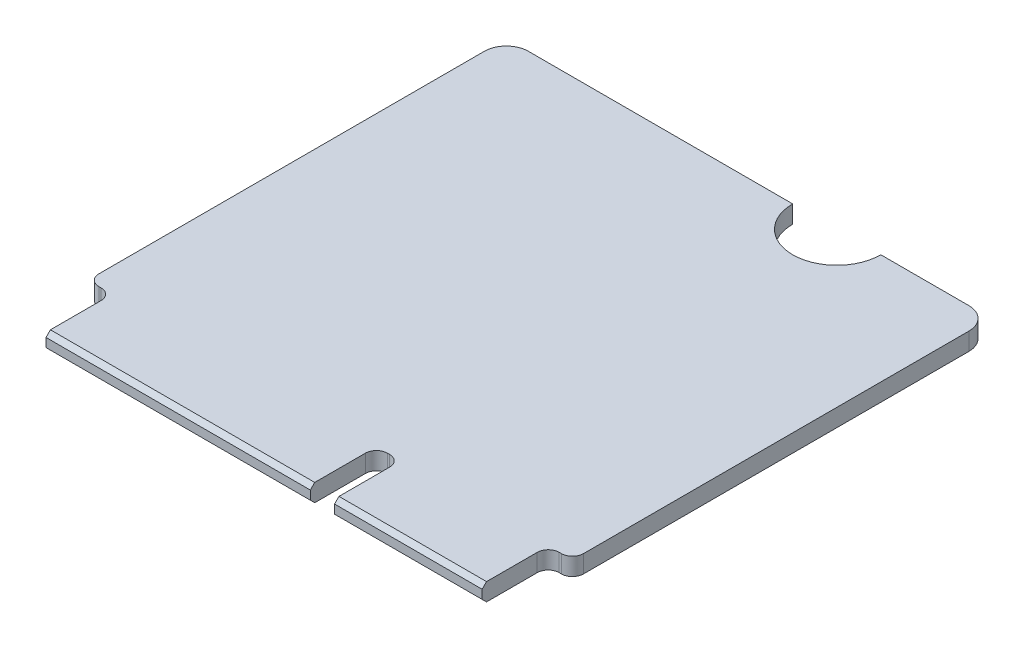
ISO-10303-21;
HEADER;
FILE_DESCRIPTION(('STEP AP214'),'2;1');
FILE_NAME('part.step','',(''),(''),'','','');
FILE_SCHEMA(('AUTOMOTIVE_DESIGN { 1 0 10303 214 1 1 1 1 }'));
ENDSEC;
DATA;
#1=APPLICATION_CONTEXT('core data for automotive mechanical design processes');
#2=APPLICATION_PROTOCOL_DEFINITION('international standard','automotive_design',2000,#1);
#3=PRODUCT_CONTEXT('',#1,'mechanical');
#4=PRODUCT('Part','Part','',(#3));
#5=PRODUCT_RELATED_PRODUCT_CATEGORY('part','',(#4));
#6=PRODUCT_DEFINITION_FORMATION('','',#4);
#7=PRODUCT_DEFINITION_CONTEXT('part definition',#1,'design');
#8=PRODUCT_DEFINITION('design','',#6,#7);
#9=PRODUCT_DEFINITION_SHAPE('','',#8);
#10=(LENGTH_UNIT() NAMED_UNIT(*) SI_UNIT(.MILLI.,.METRE.));
#11=(NAMED_UNIT(*) PLANE_ANGLE_UNIT() SI_UNIT($,.RADIAN.));
#12=(NAMED_UNIT(*) SI_UNIT($,.STERADIAN.) SOLID_ANGLE_UNIT());
#13=UNCERTAINTY_MEASURE_WITH_UNIT(LENGTH_MEASURE(1.E-05),#10,'distance_accuracy_value','');
#14=(GEOMETRIC_REPRESENTATION_CONTEXT(3) GLOBAL_UNCERTAINTY_ASSIGNED_CONTEXT((#13)) GLOBAL_UNIT_ASSIGNED_CONTEXT((#10,
#11,#12)) REPRESENTATION_CONTEXT('',''));
#15=CARTESIAN_POINT('',(0.,0.,0.));
#16=DIRECTION('',(0.,0.,1.));
#17=DIRECTION('',(1.,0.,0.));
#18=AXIS2_PLACEMENT_3D('',#15,#16,#17);
#19=CARTESIAN_POINT('',(0.,0.8,0.));
#20=DIRECTION('',(1.,0.,0.));
#21=DIRECTION('',(0.,0.,-1.));
#22=AXIS2_PLACEMENT_3D('',#19,#20,#21);
#23=PLANE('',#22);
#24=DIRECTION('',(0.,0.,1.));
#25=VECTOR('',#24,1.);
#26=CARTESIAN_POINT('',(0.,0.,0.));
#27=LINE('',#26,#25);
#28=CARTESIAN_POINT('',(0.,0.,1.));
#29=VERTEX_POINT('',#28);
#30=CARTESIAN_POINT('',(0.,0.,18.5));
#31=VERTEX_POINT('',#30);
#32=EDGE_CURVE('E238',#29,#31,#27,.T.);
#33=ORIENTED_EDGE('',*,*,#32,.T.);
#34=DIRECTION('',(0.,-1.,0.));
#35=VECTOR('',#34,1.);
#36=CARTESIAN_POINT('',(0.,0.8,18.5));
#37=LINE('',#36,#35);
#38=CARTESIAN_POINT('',(0.,0.8,18.5));
#39=VERTEX_POINT('',#38);
#40=EDGE_CURVE('E306',#31,#39,#37,.F.);
#41=ORIENTED_EDGE('',*,*,#40,.T.);
#42=DIRECTION('',(0.,0.,1.));
#43=VECTOR('',#42,1.);
#44=CARTESIAN_POINT('',(0.,0.8,0.));
#45=LINE('',#44,#43);
#46=CARTESIAN_POINT('',(0.,0.8,1.));
#47=VERTEX_POINT('',#46);
#48=EDGE_CURVE('E267',#47,#39,#45,.T.);
#49=ORIENTED_EDGE('',*,*,#48,.F.);
#50=DIRECTION('',(0.,-1.,0.));
#51=VECTOR('',#50,1.);
#52=CARTESIAN_POINT('',(0.,0.8,1.));
#53=LINE('',#52,#51);
#54=EDGE_CURVE('E292',#47,#29,#53,.T.);
#55=ORIENTED_EDGE('',*,*,#54,.T.);
#56=EDGE_LOOP('',(#33,#41,#49,#55));
#57=FACE_BOUND('',#56,.T.);
#58=ADVANCED_FACE('F33',(#57),#23,.F.);
#59=CARTESIAN_POINT('',(0.,0.8,19.));
#60=DIRECTION('',(0.,0.,-1.));
#61=DIRECTION('',(-1.,0.,0.));
#62=AXIS2_PLACEMENT_3D('',#59,#60,#61);
#63=PLANE('',#62);
#64=DIRECTION('',(1.,0.,0.));
#65=VECTOR('',#64,1.);
#66=CARTESIAN_POINT('',(0.,0.8,19.));
#67=LINE('',#66,#65);
#68=CARTESIAN_POINT('',(0.500000000000002,0.8,19.));
#69=VERTEX_POINT('',#68);
#70=CARTESIAN_POINT('',(0.600000000000002,0.8,19.));
#71=VERTEX_POINT('',#70);
#72=EDGE_CURVE('E397',#69,#71,#67,.T.);
#73=ORIENTED_EDGE('',*,*,#72,.F.);
#74=DIRECTION('',(0.,-1.,0.));
#75=VECTOR('',#74,1.);
#76=CARTESIAN_POINT('',(0.500000000000002,0.8,19.));
#77=LINE('',#76,#75);
#78=CARTESIAN_POINT('',(0.500000000000002,0.,19.));
#79=VERTEX_POINT('',#78);
#80=EDGE_CURVE('E299',#69,#79,#77,.T.);
#81=ORIENTED_EDGE('',*,*,#80,.T.);
#82=DIRECTION('',(1.,0.,0.));
#83=VECTOR('',#82,1.);
#84=CARTESIAN_POINT('',(0.,0.,19.));
#85=LINE('',#84,#83);
#86=CARTESIAN_POINT('',(0.600000000000002,0.,19.));
#87=VERTEX_POINT('',#86);
#88=EDGE_CURVE('E241',#79,#87,#85,.T.);
#89=ORIENTED_EDGE('',*,*,#88,.T.);
#90=DIRECTION('',(0.,-1.,0.));
#91=VECTOR('',#90,1.);
#92=CARTESIAN_POINT('',(0.600000000000002,0.8,19.));
#93=LINE('',#92,#91);
#94=EDGE_CURVE('E297',#87,#71,#93,.F.);
#95=ORIENTED_EDGE('',*,*,#94,.T.);
#96=EDGE_LOOP('',(#73,#81,#89,#95));
#97=FACE_BOUND('',#96,.T.);
#98=ADVANCED_FACE('F462',(#97),#63,.F.);
#99=CARTESIAN_POINT('',(1.1,0.8,19.));
#100=DIRECTION('',(1.,0.,0.));
#101=DIRECTION('',(0.,0.,-1.));
#102=AXIS2_PLACEMENT_3D('',#99,#100,#101);
#103=PLANE('',#102);
#104=DIRECTION('',(0.,0.,1.));
#105=VECTOR('',#104,1.);
#106=CARTESIAN_POINT('',(1.1,0.,19.));
#107=LINE('',#106,#105);
#108=CARTESIAN_POINT('',(1.1,0.,19.5));
#109=VERTEX_POINT('',#108);
#110=CARTESIAN_POINT('',(1.1,0.,21.8));
#111=VERTEX_POINT('',#110);
#112=EDGE_CURVE('E244',#109,#111,#107,.T.);
#113=ORIENTED_EDGE('',*,*,#112,.T.);
#114=DIRECTION('',(0.,-0.707106781186548,-0.707106781186548));
#115=VECTOR('',#114,1.);
#116=CARTESIAN_POINT('',(1.1,0.199999999999999,22.));
#117=LINE('',#116,#115);
#118=CARTESIAN_POINT('',(1.1,0.199999999999999,22.));
#119=VERTEX_POINT('',#118);
#120=EDGE_CURVE('E11',#111,#119,#117,.F.);
#121=ORIENTED_EDGE('',*,*,#120,.T.);
#122=DIRECTION('',(0.,-1.,0.));
#123=VECTOR('',#122,1.);
#124=CARTESIAN_POINT('',(1.1,0.8,22.));
#125=LINE('',#124,#123);
#126=CARTESIAN_POINT('',(1.1,0.600000000000001,22.));
#127=VERTEX_POINT('',#126);
#128=EDGE_CURVE('E277',#127,#119,#125,.T.);
#129=ORIENTED_EDGE('',*,*,#128,.F.);
#130=DIRECTION('',(0.,0.707106781186548,-0.707106781186548));
#131=VECTOR('',#130,1.);
#132=CARTESIAN_POINT('',(1.1,0.800000000000005,21.8));
#133=LINE('',#132,#131);
#134=CARTESIAN_POINT('',(1.1,0.8,21.8));
#135=VERTEX_POINT('',#134);
#136=EDGE_CURVE('E41',#127,#135,#133,.T.);
#137=ORIENTED_EDGE('',*,*,#136,.T.);
#138=DIRECTION('',(0.,0.,1.));
#139=VECTOR('',#138,1.);
#140=CARTESIAN_POINT('',(1.1,0.8,19.));
#141=LINE('',#140,#139);
#142=CARTESIAN_POINT('',(1.1,0.8,19.5));
#143=VERTEX_POINT('',#142);
#144=EDGE_CURVE('E389',#143,#135,#141,.T.);
#145=ORIENTED_EDGE('',*,*,#144,.F.);
#146=DIRECTION('',(0.,-1.,0.));
#147=VECTOR('',#146,1.);
#148=CARTESIAN_POINT('',(1.1,0.,19.5));
#149=LINE('',#148,#147);
#150=EDGE_CURVE('E312',#143,#109,#149,.T.);
#151=ORIENTED_EDGE('',*,*,#150,.T.);
#152=EDGE_LOOP('',(#113,#121,#129,#137,#145,#151));
#153=FACE_BOUND('',#152,.T.);
#154=ADVANCED_FACE('F388',(#153),#103,.F.);
#155=CARTESIAN_POINT('',(1.1,0.8,22.));
#156=DIRECTION('',(0.,0.,-1.));
#157=DIRECTION('',(-1.,0.,0.));
#158=AXIS2_PLACEMENT_3D('',#155,#156,#157);
#159=PLANE('',#158);
#160=ORIENTED_EDGE('',*,*,#128,.T.);
#161=DIRECTION('',(1.,0.,0.));
#162=VECTOR('',#161,1.);
#163=CARTESIAN_POINT('',(1.1,0.199999999999999,22.));
#164=LINE('',#163,#162);
#165=CARTESIAN_POINT('',(13.1,0.199999999999999,22.));
#166=VERTEX_POINT('',#165);
#167=EDGE_CURVE('E379',#119,#166,#164,.T.);
#168=ORIENTED_EDGE('',*,*,#167,.T.);
#169=DIRECTION('',(0.,-1.,0.));
#170=VECTOR('',#169,1.);
#171=CARTESIAN_POINT('',(13.1,0.8,22.));
#172=LINE('',#171,#170);
#173=CARTESIAN_POINT('',(13.1,0.600000000000001,22.));
#174=VERTEX_POINT('',#173);
#175=EDGE_CURVE('E274',#174,#166,#172,.T.);
#176=ORIENTED_EDGE('',*,*,#175,.F.);
#177=DIRECTION('',(-1.,0.,0.));
#178=VECTOR('',#177,1.);
#179=CARTESIAN_POINT('',(1.1,0.600000000000001,22.));
#180=LINE('',#179,#178);
#181=EDGE_CURVE('E53',#174,#127,#180,.T.);
#182=ORIENTED_EDGE('',*,*,#181,.T.);
#183=EDGE_LOOP('',(#160,#168,#176,#182));
#184=FACE_BOUND('',#183,.T.);
#185=ADVANCED_FACE('F401',(#184),#159,.F.);
#186=CARTESIAN_POINT('',(13.1,0.8,22.));
#187=DIRECTION('',(-1.,0.,0.));
#188=DIRECTION('',(0.,0.,1.));
#189=AXIS2_PLACEMENT_3D('',#186,#187,#188);
#190=PLANE('',#189);
#191=ORIENTED_EDGE('',*,*,#175,.T.);
#192=DIRECTION('',(0.,0.707106781186548,0.707106781186548));
#193=VECTOR('',#192,1.);
#194=CARTESIAN_POINT('',(13.1,0.199999999999999,22.));
#195=LINE('',#194,#193);
#196=CARTESIAN_POINT('',(13.1,0.,21.8));
#197=VERTEX_POINT('',#196);
#198=EDGE_CURVE('E384',#166,#197,#195,.F.);
#199=ORIENTED_EDGE('',*,*,#198,.T.);
#200=DIRECTION('',(0.,0.,-1.));
#201=VECTOR('',#200,1.);
#202=CARTESIAN_POINT('',(13.1,0.,22.));
#203=LINE('',#202,#201);
#204=CARTESIAN_POINT('',(13.1,0.,19.5));
#205=VERTEX_POINT('',#204);
#206=EDGE_CURVE('E246',#197,#205,#203,.T.);
#207=ORIENTED_EDGE('',*,*,#206,.T.);
#208=DIRECTION('',(0.,-1.,0.));
#209=VECTOR('',#208,1.);
#210=CARTESIAN_POINT('',(13.1,0.8,19.5));
#211=LINE('',#210,#209);
#212=CARTESIAN_POINT('',(13.1,0.8,19.5));
#213=VERTEX_POINT('',#212);
#214=EDGE_CURVE('E323',#205,#213,#211,.F.);
#215=ORIENTED_EDGE('',*,*,#214,.T.);
#216=DIRECTION('',(0.,0.,-1.));
#217=VECTOR('',#216,1.);
#218=CARTESIAN_POINT('',(13.1,0.8,22.));
#219=LINE('',#218,#217);
#220=CARTESIAN_POINT('',(13.1,0.8,21.8));
#221=VERTEX_POINT('',#220);
#222=EDGE_CURVE('E396',#221,#213,#219,.T.);
#223=ORIENTED_EDGE('',*,*,#222,.F.);
#224=DIRECTION('',(0.,-0.707106781186548,0.707106781186548));
#225=VECTOR('',#224,1.);
#226=CARTESIAN_POINT('',(13.1,0.8,21.8));
#227=LINE('',#226,#225);
#228=EDGE_CURVE('E382',#221,#174,#227,.T.);
#229=ORIENTED_EDGE('',*,*,#228,.T.);
#230=EDGE_LOOP('',(#191,#199,#207,#215,#223,#229));
#231=FACE_BOUND('',#230,.T.);
#232=ADVANCED_FACE('F400',(#231),#190,.F.);
#233=CARTESIAN_POINT('',(13.1,0.8,19.));
#234=DIRECTION('',(0.,0.,-1.));
#235=DIRECTION('',(-1.,0.,0.));
#236=AXIS2_PLACEMENT_3D('',#233,#234,#235);
#237=PLANE('',#236);
#238=DIRECTION('',(1.,0.,0.));
#239=VECTOR('',#238,1.);
#240=CARTESIAN_POINT('',(13.1,0.,19.));
#241=LINE('',#240,#239);
#242=CARTESIAN_POINT('',(13.6,0.,19.));
#243=VERTEX_POINT('',#242);
#244=CARTESIAN_POINT('',(13.7,0.,19.));
#245=VERTEX_POINT('',#244);
#246=EDGE_CURVE('E248',#243,#245,#241,.T.);
#247=ORIENTED_EDGE('',*,*,#246,.T.);
#248=DIRECTION('',(0.,-1.,0.));
#249=VECTOR('',#248,1.);
#250=CARTESIAN_POINT('',(13.7,0.8,19.));
#251=LINE('',#250,#249);
#252=CARTESIAN_POINT('',(13.7,0.8,19.));
#253=VERTEX_POINT('',#252);
#254=EDGE_CURVE('E321',#245,#253,#251,.F.);
#255=ORIENTED_EDGE('',*,*,#254,.T.);
#256=DIRECTION('',(1.,0.,0.));
#257=VECTOR('',#256,1.);
#258=CARTESIAN_POINT('',(13.1,0.8,19.));
#259=LINE('',#258,#257);
#260=CARTESIAN_POINT('',(13.6,0.8,19.));
#261=VERTEX_POINT('',#260);
#262=EDGE_CURVE('E419',#261,#253,#259,.T.);
#263=ORIENTED_EDGE('',*,*,#262,.F.);
#264=DIRECTION('',(0.,-1.,0.));
#265=VECTOR('',#264,1.);
#266=CARTESIAN_POINT('',(13.6,0.,19.));
#267=LINE('',#266,#265);
#268=EDGE_CURVE('E318',#261,#243,#267,.T.);
#269=ORIENTED_EDGE('',*,*,#268,.T.);
#270=EDGE_LOOP('',(#247,#255,#263,#269));
#271=FACE_BOUND('',#270,.T.);
#272=ADVANCED_FACE('F422',(#271),#237,.F.);
#273=CARTESIAN_POINT('',(14.2,0.8,22.));
#274=DIRECTION('',(1.,0.,0.));
#275=DIRECTION('',(0.,0.,-1.));
#276=AXIS2_PLACEMENT_3D('',#273,#274,#275);
#277=PLANE('',#276);
#278=DIRECTION('',(0.,0.,1.));
#279=VECTOR('',#278,1.);
#280=CARTESIAN_POINT('',(14.2,0.,22.));
#281=LINE('',#280,#279);
#282=CARTESIAN_POINT('',(14.2,0.,19.5));
#283=VERTEX_POINT('',#282);
#284=CARTESIAN_POINT('',(14.2,0.,21.8));
#285=VERTEX_POINT('',#284);
#286=EDGE_CURVE('E251',#283,#285,#281,.T.);
#287=ORIENTED_EDGE('',*,*,#286,.T.);
#288=DIRECTION('',(0.,-0.707106781186548,-0.707106781186548));
#289=VECTOR('',#288,1.);
#290=CARTESIAN_POINT('',(14.2,0.199999999999999,22.));
#291=LINE('',#290,#289);
#292=CARTESIAN_POINT('',(14.2,0.199999999999999,22.));
#293=VERTEX_POINT('',#292);
#294=EDGE_CURVE('E370',#285,#293,#291,.F.);
#295=ORIENTED_EDGE('',*,*,#294,.T.);
#296=DIRECTION('',(0.,-1.,0.));
#297=VECTOR('',#296,1.);
#298=CARTESIAN_POINT('',(14.2,0.8,22.));
#299=LINE('',#298,#297);
#300=CARTESIAN_POINT('',(14.2,0.600000000000001,22.));
#301=VERTEX_POINT('',#300);
#302=EDGE_CURVE('E271',#301,#293,#299,.T.);
#303=ORIENTED_EDGE('',*,*,#302,.F.);
#304=DIRECTION('',(0.,0.707106781186548,-0.707106781186548));
#305=VECTOR('',#304,1.);
#306=CARTESIAN_POINT('',(14.2,0.8,21.8));
#307=LINE('',#306,#305);
#308=CARTESIAN_POINT('',(14.2,0.8,21.8));
#309=VERTEX_POINT('',#308);
#310=EDGE_CURVE('E368',#301,#309,#307,.T.);
#311=ORIENTED_EDGE('',*,*,#310,.T.);
#312=DIRECTION('',(0.,0.,1.));
#313=VECTOR('',#312,1.);
#314=CARTESIAN_POINT('',(14.2,0.8,22.));
#315=LINE('',#314,#313);
#316=CARTESIAN_POINT('',(14.2,0.8,19.5));
#317=VERTEX_POINT('',#316);
#318=EDGE_CURVE('E424',#317,#309,#315,.T.);
#319=ORIENTED_EDGE('',*,*,#318,.F.);
#320=DIRECTION('',(0.,-1.,0.));
#321=VECTOR('',#320,1.);
#322=CARTESIAN_POINT('',(14.2,0.,19.5));
#323=LINE('',#322,#321);
#324=EDGE_CURVE('E315',#317,#283,#323,.T.);
#325=ORIENTED_EDGE('',*,*,#324,.T.);
#326=EDGE_LOOP('',(#287,#295,#303,#311,#319,#325));
#327=FACE_BOUND('',#326,.T.);
#328=ADVANCED_FACE('F575',(#327),#277,.F.);
#329=CARTESIAN_POINT('',(14.2,0.8,22.));
#330=DIRECTION('',(0.,0.,-1.));
#331=DIRECTION('',(-1.,0.,0.));
#332=AXIS2_PLACEMENT_3D('',#329,#330,#331);
#333=PLANE('',#332);
#334=ORIENTED_EDGE('',*,*,#302,.T.);
#335=DIRECTION('',(1.,0.,0.));
#336=VECTOR('',#335,1.);
#337=CARTESIAN_POINT('',(14.2,0.199999999999999,22.));
#338=LINE('',#337,#336);
#339=CARTESIAN_POINT('',(20.9,0.199999999999999,22.));
#340=VERTEX_POINT('',#339);
#341=EDGE_CURVE('E357',#293,#340,#338,.T.);
#342=ORIENTED_EDGE('',*,*,#341,.T.);
#343=DIRECTION('',(0.,-1.,0.));
#344=VECTOR('',#343,1.);
#345=CARTESIAN_POINT('',(20.9,0.8,22.));
#346=LINE('',#345,#344);
#347=CARTESIAN_POINT('',(20.9,0.600000000000001,22.));
#348=VERTEX_POINT('',#347);
#349=EDGE_CURVE('E227',#348,#340,#346,.T.);
#350=ORIENTED_EDGE('',*,*,#349,.F.);
#351=DIRECTION('',(-1.,0.,0.));
#352=VECTOR('',#351,1.);
#353=CARTESIAN_POINT('',(14.2,0.600000000000001,22.));
#354=LINE('',#353,#352);
#355=EDGE_CURVE('E355',#348,#301,#354,.T.);
#356=ORIENTED_EDGE('',*,*,#355,.T.);
#357=EDGE_LOOP('',(#334,#342,#350,#356));
#358=FACE_BOUND('',#357,.T.);
#359=ADVANCED_FACE('F580',(#358),#333,.F.);
#360=CARTESIAN_POINT('',(20.9,0.8,19.));
#361=DIRECTION('',(-1.,0.,0.));
#362=DIRECTION('',(0.,0.,1.));
#363=AXIS2_PLACEMENT_3D('',#360,#361,#362);
#364=PLANE('',#363);
#365=ORIENTED_EDGE('',*,*,#349,.T.);
#366=DIRECTION('',(0.,0.707106781186548,0.707106781186548));
#367=VECTOR('',#366,1.);
#368=CARTESIAN_POINT('',(20.9,0.199999999999999,22.));
#369=LINE('',#368,#367);
#370=CARTESIAN_POINT('',(20.9,0.,21.8));
#371=VERTEX_POINT('',#370);
#372=EDGE_CURVE('E362',#340,#371,#369,.F.);
#373=ORIENTED_EDGE('',*,*,#372,.T.);
#374=DIRECTION('',(0.,0.,-1.));
#375=VECTOR('',#374,1.);
#376=CARTESIAN_POINT('',(20.9,0.,19.));
#377=LINE('',#376,#375);
#378=CARTESIAN_POINT('',(20.9,0.,19.5));
#379=VERTEX_POINT('',#378);
#380=EDGE_CURVE('E254',#371,#379,#377,.T.);
#381=ORIENTED_EDGE('',*,*,#380,.T.);
#382=DIRECTION('',(0.,-1.,0.));
#383=VECTOR('',#382,1.);
#384=CARTESIAN_POINT('',(20.9,0.8,19.5));
#385=LINE('',#384,#383);
#386=CARTESIAN_POINT('',(20.9,0.8,19.5));
#387=VERTEX_POINT('',#386);
#388=EDGE_CURVE('E334',#379,#387,#385,.F.);
#389=ORIENTED_EDGE('',*,*,#388,.T.);
#390=DIRECTION('',(0.,0.,-1.));
#391=VECTOR('',#390,1.);
#392=CARTESIAN_POINT('',(20.9,0.8,19.));
#393=LINE('',#392,#391);
#394=CARTESIAN_POINT('',(20.9,0.8,21.8));
#395=VERTEX_POINT('',#394);
#396=EDGE_CURVE('E426',#395,#387,#393,.T.);
#397=ORIENTED_EDGE('',*,*,#396,.F.);
#398=DIRECTION('',(0.,-0.707106781186548,0.707106781186548));
#399=VECTOR('',#398,1.);
#400=CARTESIAN_POINT('',(20.9,0.8,21.8));
#401=LINE('',#400,#399);
#402=EDGE_CURVE('E360',#395,#348,#401,.T.);
#403=ORIENTED_EDGE('',*,*,#402,.T.);
#404=EDGE_LOOP('',(#365,#373,#381,#389,#397,#403));
#405=FACE_BOUND('',#404,.T.);
#406=ADVANCED_FACE('F590',(#405),#364,.F.);
#407=CARTESIAN_POINT('',(22.,0.8,19.));
#408=DIRECTION('',(0.,0.,-1.));
#409=DIRECTION('',(-1.,0.,0.));
#410=AXIS2_PLACEMENT_3D('',#407,#408,#409);
#411=PLANE('',#410);
#412=DIRECTION('',(1.,0.,0.));
#413=VECTOR('',#412,1.);
#414=CARTESIAN_POINT('',(22.,0.,19.));
#415=LINE('',#414,#413);
#416=CARTESIAN_POINT('',(21.4,0.,19.));
#417=VERTEX_POINT('',#416);
#418=CARTESIAN_POINT('',(21.5,0.,19.));
#419=VERTEX_POINT('',#418);
#420=EDGE_CURVE('E256',#417,#419,#415,.T.);
#421=ORIENTED_EDGE('',*,*,#420,.T.);
#422=DIRECTION('',(0.,-1.,0.));
#423=VECTOR('',#422,1.);
#424=CARTESIAN_POINT('',(21.5,0.8,19.));
#425=LINE('',#424,#423);
#426=CARTESIAN_POINT('',(21.5,0.8,19.));
#427=VERTEX_POINT('',#426);
#428=EDGE_CURVE('E332',#419,#427,#425,.F.);
#429=ORIENTED_EDGE('',*,*,#428,.T.);
#430=DIRECTION('',(1.,0.,0.));
#431=VECTOR('',#430,1.);
#432=CARTESIAN_POINT('',(22.,0.8,19.));
#433=LINE('',#432,#431);
#434=CARTESIAN_POINT('',(21.4,0.8,19.));
#435=VERTEX_POINT('',#434);
#436=EDGE_CURVE('E431',#435,#427,#433,.T.);
#437=ORIENTED_EDGE('',*,*,#436,.F.);
#438=DIRECTION('',(0.,-1.,0.));
#439=VECTOR('',#438,1.);
#440=CARTESIAN_POINT('',(21.4,0.,19.));
#441=LINE('',#440,#439);
#442=EDGE_CURVE('E329',#435,#417,#441,.T.);
#443=ORIENTED_EDGE('',*,*,#442,.T.);
#444=EDGE_LOOP('',(#421,#429,#437,#443));
#445=FACE_BOUND('',#444,.T.);
#446=ADVANCED_FACE('F600',(#445),#411,.F.);
#447=CARTESIAN_POINT('',(22.,0.8,0.));
#448=DIRECTION('',(-1.,0.,0.));
#449=DIRECTION('',(0.,0.,1.));
#450=AXIS2_PLACEMENT_3D('',#447,#448,#449);
#451=PLANE('',#450);
#452=DIRECTION('',(0.,0.,-1.));
#453=VECTOR('',#452,1.);
#454=CARTESIAN_POINT('',(22.,0.8,0.));
#455=LINE('',#454,#453);
#456=CARTESIAN_POINT('',(22.,0.8,18.5));
#457=VERTEX_POINT('',#456);
#458=CARTESIAN_POINT('',(22.,0.8,1.));
#459=VERTEX_POINT('',#458);
#460=EDGE_CURVE('E218',#457,#459,#455,.T.);
#461=ORIENTED_EDGE('',*,*,#460,.F.);
#462=DIRECTION('',(0.,-1.,0.));
#463=VECTOR('',#462,1.);
#464=CARTESIAN_POINT('',(22.,0.8,18.5));
#465=LINE('',#464,#463);
#466=CARTESIAN_POINT('',(22.,0.,18.5));
#467=VERTEX_POINT('',#466);
#468=EDGE_CURVE('E326',#457,#467,#465,.T.);
#469=ORIENTED_EDGE('',*,*,#468,.T.);
#470=DIRECTION('',(0.,0.,-1.));
#471=VECTOR('',#470,1.);
#472=CARTESIAN_POINT('',(22.,0.,0.));
#473=LINE('',#472,#471);
#474=CARTESIAN_POINT('',(22.,0.,1.));
#475=VERTEX_POINT('',#474);
#476=EDGE_CURVE('E259',#467,#475,#473,.T.);
#477=ORIENTED_EDGE('',*,*,#476,.T.);
#478=DIRECTION('',(0.,-1.,0.));
#479=VECTOR('',#478,1.);
#480=CARTESIAN_POINT('',(22.,0.8,1.));
#481=LINE('',#480,#479);
#482=EDGE_CURVE('E286',#475,#459,#481,.F.);
#483=ORIENTED_EDGE('',*,*,#482,.T.);
#484=EDGE_LOOP('',(#461,#469,#477,#483));
#485=FACE_BOUND('',#484,.T.);
#486=ADVANCED_FACE('F438',(#485),#451,.F.);
#487=CARTESIAN_POINT('',(17.,0.8,0.));
#488=DIRECTION('',(0.,0.,1.));
#489=DIRECTION('',(1.,0.,0.));
#490=AXIS2_PLACEMENT_3D('',#487,#488,#489);
#491=PLANE('',#490);
#492=DIRECTION('',(-1.,0.,0.));
#493=VECTOR('',#492,1.);
#494=CARTESIAN_POINT('',(17.,0.8,0.));
#495=LINE('',#494,#493);
#496=CARTESIAN_POINT('',(21.,0.8,0.));
#497=VERTEX_POINT('',#496);
#498=CARTESIAN_POINT('',(17.,0.8,0.));
#499=VERTEX_POINT('',#498);
#500=EDGE_CURVE('E205',#497,#499,#495,.T.);
#501=ORIENTED_EDGE('',*,*,#500,.F.);
#502=DIRECTION('',(0.,-1.,0.));
#503=VECTOR('',#502,1.);
#504=CARTESIAN_POINT('',(21.,0.8,0.));
#505=LINE('',#504,#503);
#506=CARTESIAN_POINT('',(21.,0.,0.));
#507=VERTEX_POINT('',#506);
#508=EDGE_CURVE('E279',#497,#507,#505,.T.);
#509=ORIENTED_EDGE('',*,*,#508,.T.);
#510=DIRECTION('',(-1.,0.,0.));
#511=VECTOR('',#510,1.);
#512=CARTESIAN_POINT('',(17.,0.,0.));
#513=LINE('',#512,#511);
#514=CARTESIAN_POINT('',(17.,0.,0.));
#515=VERTEX_POINT('',#514);
#516=EDGE_CURVE('E224',#507,#515,#513,.T.);
#517=ORIENTED_EDGE('',*,*,#516,.T.);
#518=DIRECTION('',(0.,-1.,0.));
#519=VECTOR('',#518,1.);
#520=CARTESIAN_POINT('',(17.,0.8,0.));
#521=LINE('',#520,#519);
#522=EDGE_CURVE('E221',#499,#515,#521,.T.);
#523=ORIENTED_EDGE('',*,*,#522,.F.);
#524=EDGE_LOOP('',(#501,#509,#517,#523));
#525=FACE_BOUND('',#524,.T.);
#526=ADVANCED_FACE('F222',(#525),#491,.F.);
#527=CARTESIAN_POINT('',(15.,0.8,0.));
#528=DIRECTION('',(0.,-1.,0.));
#529=DIRECTION('',(0.,0.,-1.));
#530=AXIS2_PLACEMENT_3D('',#527,#528,#529);
#531=CYLINDRICAL_SURFACE('',#530,2.);
#532=CARTESIAN_POINT('',(15.,0.,0.));
#533=DIRECTION('',(0.,-1.,0.));
#534=DIRECTION('',(0.,0.,1.));
#535=AXIS2_PLACEMENT_3D('',#532,#533,#534);
#536=CIRCLE('',#535,2.);
#537=CARTESIAN_POINT('',(13.,0.,0.));
#538=VERTEX_POINT('',#537);
#539=EDGE_CURVE('E262',#515,#538,#536,.T.);
#540=ORIENTED_EDGE('',*,*,#539,.T.);
#541=DIRECTION('',(0.,-1.,0.));
#542=VECTOR('',#541,1.);
#543=CARTESIAN_POINT('',(13.,0.8,0.));
#544=LINE('',#543,#542);
#545=CARTESIAN_POINT('',(13.,0.8,0.));
#546=VERTEX_POINT('',#545);
#547=EDGE_CURVE('E228',#546,#538,#544,.T.);
#548=ORIENTED_EDGE('',*,*,#547,.F.);
#549=CARTESIAN_POINT('',(15.,0.8,0.));
#550=DIRECTION('',(0.,-1.,0.));
#551=DIRECTION('',(0.,0.,1.));
#552=AXIS2_PLACEMENT_3D('',#549,#550,#551);
#553=CIRCLE('',#552,2.);
#554=EDGE_CURVE('E211',#499,#546,#553,.T.);
#555=ORIENTED_EDGE('',*,*,#554,.F.);
#556=ORIENTED_EDGE('',*,*,#522,.T.);
#557=EDGE_LOOP('',(#540,#548,#555,#556));
#558=FACE_BOUND('',#557,.T.);
#559=ADVANCED_FACE('F230',(#558),#531,.F.);
#560=CARTESIAN_POINT('',(0.,0.8,0.));
#561=DIRECTION('',(0.,0.,1.));
#562=DIRECTION('',(1.,0.,0.));
#563=AXIS2_PLACEMENT_3D('',#560,#561,#562);
#564=PLANE('',#563);
#565=DIRECTION('',(-1.,0.,0.));
#566=VECTOR('',#565,1.);
#567=CARTESIAN_POINT('',(0.,0.,0.));
#568=LINE('',#567,#566);
#569=CARTESIAN_POINT('',(1.,0.,0.));
#570=VERTEX_POINT('',#569);
#571=EDGE_CURVE('E264',#538,#570,#568,.T.);
#572=ORIENTED_EDGE('',*,*,#571,.T.);
#573=DIRECTION('',(0.,-1.,0.));
#574=VECTOR('',#573,1.);
#575=CARTESIAN_POINT('',(1.,0.8,0.));
#576=LINE('',#575,#574);
#577=CARTESIAN_POINT('',(1.,0.8,0.));
#578=VERTEX_POINT('',#577);
#579=EDGE_CURVE('E295',#570,#578,#576,.F.);
#580=ORIENTED_EDGE('',*,*,#579,.T.);
#581=DIRECTION('',(-1.,0.,0.));
#582=VECTOR('',#581,1.);
#583=CARTESIAN_POINT('',(0.,0.8,0.));
#584=LINE('',#583,#582);
#585=EDGE_CURVE('E233',#546,#578,#584,.T.);
#586=ORIENTED_EDGE('',*,*,#585,.F.);
#587=ORIENTED_EDGE('',*,*,#547,.T.);
#588=EDGE_LOOP('',(#572,#580,#586,#587));
#589=FACE_BOUND('',#588,.T.);
#590=ADVANCED_FACE('F444',(#589),#564,.F.);
#591=CARTESIAN_POINT('',(15.,0.8,0.));
#592=DIRECTION('',(0.,1.,0.));
#593=DIRECTION('',(0.,0.,1.));
#594=AXIS2_PLACEMENT_3D('',#591,#592,#593);
#595=PLANE('',#594);
#596=ORIENTED_EDGE('',*,*,#318,.T.);
#597=DIRECTION('',(1.,0.,0.));
#598=VECTOR('',#597,1.);
#599=CARTESIAN_POINT('',(20.9,0.8,21.8));
#600=LINE('',#599,#598);
#601=EDGE_CURVE('E375',#309,#395,#600,.T.);
#602=ORIENTED_EDGE('',*,*,#601,.T.);
#603=ORIENTED_EDGE('',*,*,#396,.T.);
#604=CARTESIAN_POINT('',(21.4,0.8,19.5));
#605=DIRECTION('',(0.,1.,0.));
#606=DIRECTION('',(0.,0.,1.));
#607=AXIS2_PLACEMENT_3D('',#604,#605,#606);
#608=CIRCLE('',#607,0.5);
#609=EDGE_CURVE('E353',#387,#435,#608,.F.);
#610=ORIENTED_EDGE('',*,*,#609,.T.);
#611=ORIENTED_EDGE('',*,*,#436,.T.);
#612=CARTESIAN_POINT('',(21.5,0.8,18.5));
#613=DIRECTION('',(0.,1.,0.));
#614=DIRECTION('',(0.,0.,1.));
#615=AXIS2_PLACEMENT_3D('',#612,#613,#614);
#616=CIRCLE('',#615,0.5);
#617=EDGE_CURVE('E308',#427,#457,#616,.T.);
#618=ORIENTED_EDGE('',*,*,#617,.T.);
#619=ORIENTED_EDGE('',*,*,#460,.T.);
#620=CARTESIAN_POINT('',(21.,0.8,1.));
#621=DIRECTION('',(0.,1.,0.));
#622=DIRECTION('',(0.,0.,1.));
#623=AXIS2_PLACEMENT_3D('',#620,#621,#622);
#624=CIRCLE('',#623,1.);
#625=EDGE_CURVE('E214',#459,#497,#624,.T.);
#626=ORIENTED_EDGE('',*,*,#625,.T.);
#627=ORIENTED_EDGE('',*,*,#500,.T.);
#628=ORIENTED_EDGE('',*,*,#554,.T.);
#629=ORIENTED_EDGE('',*,*,#585,.T.);
#630=CARTESIAN_POINT('',(1.,0.8,1.));
#631=DIRECTION('',(0.,1.,0.));
#632=DIRECTION('',(0.,0.,1.));
#633=AXIS2_PLACEMENT_3D('',#630,#631,#632);
#634=CIRCLE('',#633,1.);
#635=EDGE_CURVE('E289',#578,#47,#634,.T.);
#636=ORIENTED_EDGE('',*,*,#635,.T.);
#637=ORIENTED_EDGE('',*,*,#48,.T.);
#638=CARTESIAN_POINT('',(0.500000000000002,0.8,18.5));
#639=DIRECTION('',(0.,1.,0.));
#640=DIRECTION('',(0.,0.,1.));
#641=AXIS2_PLACEMENT_3D('',#638,#639,#640);
#642=CIRCLE('',#641,0.5);
#643=EDGE_CURVE('E310',#39,#69,#642,.T.);
#644=ORIENTED_EDGE('',*,*,#643,.T.);
#645=ORIENTED_EDGE('',*,*,#72,.T.);
#646=CARTESIAN_POINT('',(0.600000000000002,0.8,19.5));
#647=DIRECTION('',(0.,1.,0.));
#648=DIRECTION('',(0.,0.,1.));
#649=AXIS2_PLACEMENT_3D('',#646,#647,#648);
#650=CIRCLE('',#649,0.5);
#651=EDGE_CURVE('E339',#71,#143,#650,.F.);
#652=ORIENTED_EDGE('',*,*,#651,.T.);
#653=ORIENTED_EDGE('',*,*,#144,.T.);
#654=DIRECTION('',(1.,0.,0.));
#655=VECTOR('',#654,1.);
#656=CARTESIAN_POINT('',(13.1,0.8,21.8));
#657=LINE('',#656,#655);
#658=EDGE_CURVE('E372',#135,#221,#657,.T.);
#659=ORIENTED_EDGE('',*,*,#658,.T.);
#660=ORIENTED_EDGE('',*,*,#222,.T.);
#661=CARTESIAN_POINT('',(13.6,0.8,19.5));
#662=DIRECTION('',(0.,1.,0.));
#663=DIRECTION('',(0.,0.,1.));
#664=AXIS2_PLACEMENT_3D('',#661,#662,#663);
#665=CIRCLE('',#664,0.5);
#666=EDGE_CURVE('E348',#213,#261,#665,.F.);
#667=ORIENTED_EDGE('',*,*,#666,.T.);
#668=ORIENTED_EDGE('',*,*,#262,.T.);
#669=CARTESIAN_POINT('',(13.7,0.8,19.5));
#670=DIRECTION('',(0.,1.,0.));
#671=DIRECTION('',(0.,0.,1.));
#672=AXIS2_PLACEMENT_3D('',#669,#670,#671);
#673=CIRCLE('',#672,0.5);
#674=EDGE_CURVE('E343',#253,#317,#673,.F.);
#675=ORIENTED_EDGE('',*,*,#674,.T.);
#676=EDGE_LOOP('',(#596,#602,#603,#610,#611,#618,#619,#626,#627,#628,#629,#636,#637,#644,#645,
#652,#653,#659,#660,#667,#668,#675));
#677=FACE_BOUND('',#676,.T.);
#678=ADVANCED_FACE('F208',(#677),#595,.T.);
#679=CARTESIAN_POINT('',(15.,0.,0.));
#680=DIRECTION('',(0.,1.,0.));
#681=DIRECTION('',(0.,0.,1.));
#682=AXIS2_PLACEMENT_3D('',#679,#680,#681);
#683=PLANE('',#682);
#684=ORIENTED_EDGE('',*,*,#380,.F.);
#685=DIRECTION('',(-1.,0.,0.));
#686=VECTOR('',#685,1.);
#687=CARTESIAN_POINT('',(15.,0.,21.8));
#688=LINE('',#687,#686);
#689=EDGE_CURVE('E366',#371,#285,#688,.T.);
#690=ORIENTED_EDGE('',*,*,#689,.T.);
#691=ORIENTED_EDGE('',*,*,#286,.F.);
#692=CARTESIAN_POINT('',(13.7,0.,19.5));
#693=DIRECTION('',(0.,1.,0.));
#694=DIRECTION('',(0.,0.,1.));
#695=AXIS2_PLACEMENT_3D('',#692,#693,#694);
#696=CIRCLE('',#695,0.5);
#697=EDGE_CURVE('E341',#283,#245,#696,.T.);
#698=ORIENTED_EDGE('',*,*,#697,.T.);
#699=ORIENTED_EDGE('',*,*,#246,.F.);
#700=CARTESIAN_POINT('',(13.6,0.,19.5));
#701=DIRECTION('',(0.,1.,0.));
#702=DIRECTION('',(0.,0.,1.));
#703=AXIS2_PLACEMENT_3D('',#700,#701,#702);
#704=CIRCLE('',#703,0.5);
#705=EDGE_CURVE('E345',#243,#205,#704,.T.);
#706=ORIENTED_EDGE('',*,*,#705,.T.);
#707=ORIENTED_EDGE('',*,*,#206,.F.);
#708=DIRECTION('',(-1.,0.,0.));
#709=VECTOR('',#708,1.);
#710=CARTESIAN_POINT('',(15.,0.,21.8));
#711=LINE('',#710,#709);
#712=EDGE_CURVE('E364',#197,#111,#711,.T.);
#713=ORIENTED_EDGE('',*,*,#712,.T.);
#714=ORIENTED_EDGE('',*,*,#112,.F.);
#715=CARTESIAN_POINT('',(0.600000000000002,0.,19.5));
#716=DIRECTION('',(0.,1.,0.));
#717=DIRECTION('',(0.,0.,1.));
#718=AXIS2_PLACEMENT_3D('',#715,#716,#717);
#719=CIRCLE('',#718,0.5);
#720=EDGE_CURVE('E337',#109,#87,#719,.T.);
#721=ORIENTED_EDGE('',*,*,#720,.T.);
#722=ORIENTED_EDGE('',*,*,#88,.F.);
#723=CARTESIAN_POINT('',(0.500000000000002,0.,18.5));
#724=DIRECTION('',(0.,1.,0.));
#725=DIRECTION('',(0.,0.,1.));
#726=AXIS2_PLACEMENT_3D('',#723,#724,#725);
#727=CIRCLE('',#726,0.5);
#728=EDGE_CURVE('E304',#79,#31,#727,.F.);
#729=ORIENTED_EDGE('',*,*,#728,.T.);
#730=ORIENTED_EDGE('',*,*,#32,.F.);
#731=CARTESIAN_POINT('',(1.,0.,1.));
#732=DIRECTION('',(0.,1.,0.));
#733=DIRECTION('',(0.,0.,1.));
#734=AXIS2_PLACEMENT_3D('',#731,#732,#733);
#735=CIRCLE('',#734,1.);
#736=EDGE_CURVE('E281',#29,#570,#735,.F.);
#737=ORIENTED_EDGE('',*,*,#736,.T.);
#738=ORIENTED_EDGE('',*,*,#571,.F.);
#739=ORIENTED_EDGE('',*,*,#539,.F.);
#740=ORIENTED_EDGE('',*,*,#516,.F.);
#741=CARTESIAN_POINT('',(21.,0.,1.));
#742=DIRECTION('',(0.,1.,0.));
#743=DIRECTION('',(0.,0.,1.));
#744=AXIS2_PLACEMENT_3D('',#741,#742,#743);
#745=CIRCLE('',#744,1.);
#746=EDGE_CURVE('E283',#507,#475,#745,.F.);
#747=ORIENTED_EDGE('',*,*,#746,.T.);
#748=ORIENTED_EDGE('',*,*,#476,.F.);
#749=CARTESIAN_POINT('',(21.5,0.,18.5));
#750=DIRECTION('',(0.,1.,0.));
#751=DIRECTION('',(0.,0.,1.));
#752=AXIS2_PLACEMENT_3D('',#749,#750,#751);
#753=CIRCLE('',#752,0.5);
#754=EDGE_CURVE('E302',#467,#419,#753,.F.);
#755=ORIENTED_EDGE('',*,*,#754,.T.);
#756=ORIENTED_EDGE('',*,*,#420,.F.);
#757=CARTESIAN_POINT('',(21.4,0.,19.5));
#758=DIRECTION('',(0.,1.,0.));
#759=DIRECTION('',(0.,0.,1.));
#760=AXIS2_PLACEMENT_3D('',#757,#758,#759);
#761=CIRCLE('',#760,0.5);
#762=EDGE_CURVE('E350',#417,#379,#761,.T.);
#763=ORIENTED_EDGE('',*,*,#762,.T.);
#764=EDGE_LOOP('',(#684,#690,#691,#698,#699,#706,#707,#713,#714,#721,#722,#729,#730,#737,#738,
#739,#740,#747,#748,#755,#756,#763));
#765=FACE_BOUND('',#764,.T.);
#766=ADVANCED_FACE('F409',(#765),#683,.F.);
#767=CARTESIAN_POINT('',(21.,0.8,1.));
#768=DIRECTION('',(0.,-1.,0.));
#769=DIRECTION('',(0.,0.,-1.));
#770=AXIS2_PLACEMENT_3D('',#767,#768,#769);
#771=CYLINDRICAL_SURFACE('',#770,1.);
#772=ORIENTED_EDGE('',*,*,#625,.F.);
#773=ORIENTED_EDGE('',*,*,#482,.F.);
#774=ORIENTED_EDGE('',*,*,#746,.F.);
#775=ORIENTED_EDGE('',*,*,#508,.F.);
#776=EDGE_LOOP('',(#772,#773,#774,#775));
#777=FACE_BOUND('',#776,.T.);
#778=ADVANCED_FACE('F441',(#777),#771,.T.);
#779=CARTESIAN_POINT('',(1.,0.8,1.));
#780=DIRECTION('',(0.,-1.,0.));
#781=DIRECTION('',(0.,0.,-1.));
#782=AXIS2_PLACEMENT_3D('',#779,#780,#781);
#783=CYLINDRICAL_SURFACE('',#782,1.);
#784=ORIENTED_EDGE('',*,*,#635,.F.);
#785=ORIENTED_EDGE('',*,*,#579,.F.);
#786=ORIENTED_EDGE('',*,*,#736,.F.);
#787=ORIENTED_EDGE('',*,*,#54,.F.);
#788=EDGE_LOOP('',(#784,#785,#786,#787));
#789=FACE_BOUND('',#788,.T.);
#790=ADVANCED_FACE('F451',(#789),#783,.T.);
#791=CARTESIAN_POINT('',(0.500000000000002,0.8,18.5));
#792=DIRECTION('',(0.,-1.,0.));
#793=DIRECTION('',(0.,0.,-1.));
#794=AXIS2_PLACEMENT_3D('',#791,#792,#793);
#795=CYLINDRICAL_SURFACE('',#794,0.5);
#796=ORIENTED_EDGE('',*,*,#643,.F.);
#797=ORIENTED_EDGE('',*,*,#40,.F.);
#798=ORIENTED_EDGE('',*,*,#728,.F.);
#799=ORIENTED_EDGE('',*,*,#80,.F.);
#800=EDGE_LOOP('',(#796,#797,#798,#799));
#801=FACE_BOUND('',#800,.T.);
#802=ADVANCED_FACE('F459',(#801),#795,.T.);
#803=CARTESIAN_POINT('',(0.600000000000002,0.8,19.5));
#804=DIRECTION('',(0.,1.,0.));
#805=DIRECTION('',(0.,0.,1.));
#806=AXIS2_PLACEMENT_3D('',#803,#804,#805);
#807=CYLINDRICAL_SURFACE('',#806,0.5);
#808=ORIENTED_EDGE('',*,*,#651,.F.);
#809=ORIENTED_EDGE('',*,*,#94,.F.);
#810=ORIENTED_EDGE('',*,*,#720,.F.);
#811=ORIENTED_EDGE('',*,*,#150,.F.);
#812=EDGE_LOOP('',(#808,#809,#810,#811));
#813=FACE_BOUND('',#812,.T.);
#814=ADVANCED_FACE('F467',(#813),#807,.F.);
#815=CARTESIAN_POINT('',(13.7,0.8,19.5));
#816=DIRECTION('',(0.,1.,0.));
#817=DIRECTION('',(0.,0.,1.));
#818=AXIS2_PLACEMENT_3D('',#815,#816,#817);
#819=CYLINDRICAL_SURFACE('',#818,0.5);
#820=ORIENTED_EDGE('',*,*,#674,.F.);
#821=ORIENTED_EDGE('',*,*,#254,.F.);
#822=ORIENTED_EDGE('',*,*,#697,.F.);
#823=ORIENTED_EDGE('',*,*,#324,.F.);
#824=EDGE_LOOP('',(#820,#821,#822,#823));
#825=FACE_BOUND('',#824,.T.);
#826=ADVANCED_FACE('F469',(#825),#819,.F.);
#827=CARTESIAN_POINT('',(13.6,0.8,19.5));
#828=DIRECTION('',(0.,1.,0.));
#829=DIRECTION('',(0.,0.,1.));
#830=AXIS2_PLACEMENT_3D('',#827,#828,#829);
#831=CYLINDRICAL_SURFACE('',#830,0.5);
#832=ORIENTED_EDGE('',*,*,#666,.F.);
#833=ORIENTED_EDGE('',*,*,#214,.F.);
#834=ORIENTED_EDGE('',*,*,#705,.F.);
#835=ORIENTED_EDGE('',*,*,#268,.F.);
#836=EDGE_LOOP('',(#832,#833,#834,#835));
#837=FACE_BOUND('',#836,.T.);
#838=ADVANCED_FACE('F416',(#837),#831,.F.);
#839=CARTESIAN_POINT('',(21.5,0.8,18.5));
#840=DIRECTION('',(0.,-1.,0.));
#841=DIRECTION('',(0.,0.,-1.));
#842=AXIS2_PLACEMENT_3D('',#839,#840,#841);
#843=CYLINDRICAL_SURFACE('',#842,0.5);
#844=ORIENTED_EDGE('',*,*,#617,.F.);
#845=ORIENTED_EDGE('',*,*,#428,.F.);
#846=ORIENTED_EDGE('',*,*,#754,.F.);
#847=ORIENTED_EDGE('',*,*,#468,.F.);
#848=EDGE_LOOP('',(#844,#845,#846,#847));
#849=FACE_BOUND('',#848,.T.);
#850=ADVANCED_FACE('F522',(#849),#843,.T.);
#851=CARTESIAN_POINT('',(21.4,0.8,19.5));
#852=DIRECTION('',(0.,1.,0.));
#853=DIRECTION('',(0.,0.,1.));
#854=AXIS2_PLACEMENT_3D('',#851,#852,#853);
#855=CYLINDRICAL_SURFACE('',#854,0.5);
#856=ORIENTED_EDGE('',*,*,#609,.F.);
#857=ORIENTED_EDGE('',*,*,#388,.F.);
#858=ORIENTED_EDGE('',*,*,#762,.F.);
#859=ORIENTED_EDGE('',*,*,#442,.F.);
#860=EDGE_LOOP('',(#856,#857,#858,#859));
#861=FACE_BOUND('',#860,.T.);
#862=ADVANCED_FACE('F531',(#861),#855,.F.);
#863=CARTESIAN_POINT('',(14.2,0.199999999999999,22.));
#864=DIRECTION('',(0.,0.707106781186548,-0.707106781186548));
#865=DIRECTION('',(1.,0.,0.));
#866=AXIS2_PLACEMENT_3D('',#863,#864,#865);
#867=PLANE('',#866);
#868=ORIENTED_EDGE('',*,*,#294,.F.);
#869=ORIENTED_EDGE('',*,*,#689,.F.);
#870=ORIENTED_EDGE('',*,*,#372,.F.);
#871=ORIENTED_EDGE('',*,*,#341,.F.);
#872=EDGE_LOOP('',(#868,#869,#870,#871));
#873=FACE_BOUND('',#872,.T.);
#874=ADVANCED_FACE('F541',(#873),#867,.F.);
#875=CARTESIAN_POINT('',(15.,0.8,21.8));
#876=DIRECTION('',(0.,0.707106781186548,0.707106781186548));
#877=DIRECTION('',(-1.,0.,0.));
#878=AXIS2_PLACEMENT_3D('',#875,#876,#877);
#879=PLANE('',#878);
#880=ORIENTED_EDGE('',*,*,#310,.F.);
#881=ORIENTED_EDGE('',*,*,#355,.F.);
#882=ORIENTED_EDGE('',*,*,#402,.F.);
#883=ORIENTED_EDGE('',*,*,#601,.F.);
#884=EDGE_LOOP('',(#880,#881,#882,#883));
#885=FACE_BOUND('',#884,.T.);
#886=ADVANCED_FACE('F628',(#885),#879,.T.);
#887=CARTESIAN_POINT('',(1.1,0.199999999999999,22.));
#888=DIRECTION('',(0.,0.707106781186548,-0.707106781186548));
#889=DIRECTION('',(1.,0.,0.));
#890=AXIS2_PLACEMENT_3D('',#887,#888,#889);
#891=PLANE('',#890);
#892=ORIENTED_EDGE('',*,*,#120,.F.);
#893=ORIENTED_EDGE('',*,*,#712,.F.);
#894=ORIENTED_EDGE('',*,*,#198,.F.);
#895=ORIENTED_EDGE('',*,*,#167,.F.);
#896=EDGE_LOOP('',(#892,#893,#894,#895));
#897=FACE_BOUND('',#896,.T.);
#898=ADVANCED_FACE('F404',(#897),#891,.F.);
#899=CARTESIAN_POINT('',(15.,0.8,21.8));
#900=DIRECTION('',(0.,0.707106781186548,0.707106781186548));
#901=DIRECTION('',(-1.,0.,0.));
#902=AXIS2_PLACEMENT_3D('',#899,#900,#901);
#903=PLANE('',#902);
#904=ORIENTED_EDGE('',*,*,#136,.F.);
#905=ORIENTED_EDGE('',*,*,#181,.F.);
#906=ORIENTED_EDGE('',*,*,#228,.F.);
#907=ORIENTED_EDGE('',*,*,#658,.F.);
#908=EDGE_LOOP('',(#904,#905,#906,#907));
#909=FACE_BOUND('',#908,.T.);
#910=ADVANCED_FACE('F35',(#909),#903,.T.);
#911=CLOSED_SHELL('',(#58,#98,#154,#185,#232,#272,#328,#359,#406,#446,#486,#526,#559,#590,#678,
#766,#778,#790,#802,#814,#826,#838,#850,#862,#874,#886,#898,#910));
#912=MANIFOLD_SOLID_BREP('B2',#911);
#913=ADVANCED_BREP_SHAPE_REPRESENTATION('',(#18,#912),#14);
#914=SHAPE_DEFINITION_REPRESENTATION(#9,#913);
ENDSEC;
END-ISO-10303-21;
